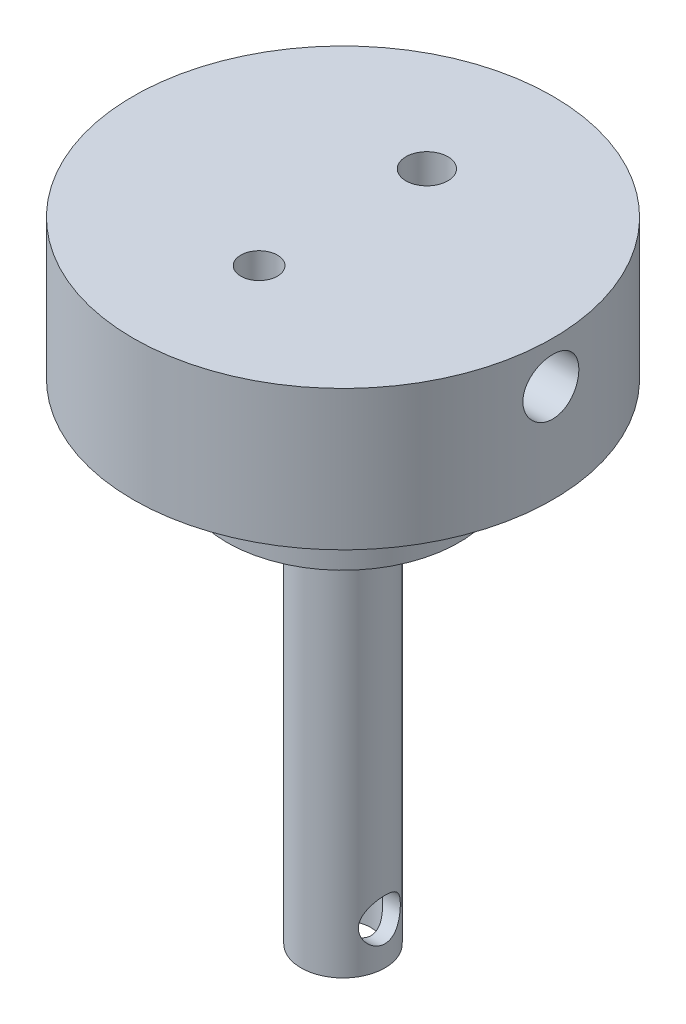
ISO-10303-21;
HEADER;
FILE_DESCRIPTION(('STEP AP214'),'2;1');
FILE_NAME('part.step','',(''),(''),'','','');
FILE_SCHEMA(('AUTOMOTIVE_DESIGN { 1 0 10303 214 1 1 1 1 }'));
ENDSEC;
DATA;
#1=APPLICATION_CONTEXT('core data for automotive mechanical design processes');
#2=APPLICATION_PROTOCOL_DEFINITION('international standard','automotive_design',2000,#1);
#3=PRODUCT_CONTEXT('',#1,'mechanical');
#4=PRODUCT('Part','Part','',(#3));
#5=PRODUCT_RELATED_PRODUCT_CATEGORY('part','',(#4));
#6=PRODUCT_DEFINITION_FORMATION('','',#4);
#7=PRODUCT_DEFINITION_CONTEXT('part definition',#1,'design');
#8=PRODUCT_DEFINITION('design','',#6,#7);
#9=PRODUCT_DEFINITION_SHAPE('','',#8);
#10=(LENGTH_UNIT() NAMED_UNIT(*) SI_UNIT(.MILLI.,.METRE.));
#11=(NAMED_UNIT(*) PLANE_ANGLE_UNIT() SI_UNIT($,.RADIAN.));
#12=(NAMED_UNIT(*) SI_UNIT($,.STERADIAN.) SOLID_ANGLE_UNIT());
#13=UNCERTAINTY_MEASURE_WITH_UNIT(LENGTH_MEASURE(1.E-05),#10,'distance_accuracy_value','');
#14=(GEOMETRIC_REPRESENTATION_CONTEXT(3) GLOBAL_UNCERTAINTY_ASSIGNED_CONTEXT((#13)) GLOBAL_UNIT_ASSIGNED_CONTEXT((#10,
#11,#12)) REPRESENTATION_CONTEXT('',''));
#15=CARTESIAN_POINT('',(0.,0.,0.));
#16=DIRECTION('',(0.,0.,1.));
#17=DIRECTION('',(1.,0.,0.));
#18=AXIS2_PLACEMENT_3D('',#15,#16,#17);
#19=CARTESIAN_POINT('',(0.,5.,0.));
#20=DIRECTION('',(0.,-1.,0.));
#21=DIRECTION('',(0.,0.,-1.));
#22=AXIS2_PLACEMENT_3D('',#19,#20,#21);
#23=CYLINDRICAL_SURFACE('',#22,7.5);
#24=CARTESIAN_POINT('',(0.,5.,0.));
#25=DIRECTION('',(0.,1.,0.));
#26=DIRECTION('',(0.,0.,1.));
#27=AXIS2_PLACEMENT_3D('',#24,#25,#26);
#28=CIRCLE('',#27,7.5);
#29=CARTESIAN_POINT('',(0.,5.,7.5));
#30=VERTEX_POINT('',#29);
#31=EDGE_CURVE('E52',#30,#30,#28,.T.);
#32=ORIENTED_EDGE('',*,*,#31,.F.);
#33=EDGE_LOOP('',(#32));
#34=FACE_BOUND('',#33,.T.);
#35=CARTESIAN_POINT('',(0.,0.,0.));
#36=DIRECTION('',(0.,1.,0.));
#37=DIRECTION('',(0.,0.,1.));
#38=AXIS2_PLACEMENT_3D('',#35,#36,#37);
#39=CIRCLE('',#38,7.5);
#40=CARTESIAN_POINT('',(0.,0.,7.5));
#41=VERTEX_POINT('',#40);
#42=EDGE_CURVE('E75',#41,#41,#39,.T.);
#43=ORIENTED_EDGE('',*,*,#42,.T.);
#44=EDGE_LOOP('',(#43));
#45=FACE_BOUND('',#44,.T.);
#46=CARTESIAN_POINT('',(7.43303437365925,3.5,-1.));
#47=CARTESIAN_POINT('',(7.43303522266631,3.44409807226988,-0.999997642974211));
#48=CARTESIAN_POINT('',(7.43367182371829,3.38816198345359,-0.995296633522848));
#49=CARTESIAN_POINT('',(7.43614824351763,3.27784876884303,-0.976618981332774));
#50=CARTESIAN_POINT('',(7.43798929330704,3.22347329754359,-0.962632848245786));
#51=CARTESIAN_POINT('',(7.44266246058434,3.11789431588298,-0.925806555700513));
#52=CARTESIAN_POINT('',(7.4454938777722,3.06668859419012,-0.902972651375006));
#53=CARTESIAN_POINT('',(7.45182791129731,2.96884446214626,-0.849112824403648));
#54=CARTESIAN_POINT('',(7.45533041990363,2.92220532053126,-0.818088216317403));
#55=CARTESIAN_POINT('',(7.46263688659337,2.83451327266549,-0.74851685244753));
#56=CARTESIAN_POINT('',(7.4664424424659,2.79349356716023,-0.709928411374281));
#57=CARTESIAN_POINT('',(7.47391188129393,2.71849187727188,-0.626414614363067));
#58=CARTESIAN_POINT('',(7.47757575696696,2.68451025426192,-0.581488933235995));
#59=CARTESIAN_POINT('',(7.48436549880109,2.62442907914178,-0.486365862463802));
#60=CARTESIAN_POINT('',(7.48748928251119,2.59835975535487,-0.43614921885561));
#61=CARTESIAN_POINT('',(7.49282926707925,2.5550369179096,-0.332001908018685));
#62=CARTESIAN_POINT('',(7.49504550607303,2.53778303381116,-0.2780713969612));
#63=CARTESIAN_POINT('',(7.49830943097799,2.51268054520987,-0.168367687507044));
#64=CARTESIAN_POINT('',(7.49936399102537,2.50477659249402,-0.112607361734948));
#65=CARTESIAN_POINT('',(7.5002092398576,2.49842669563159,-0.000542501151828087));
#66=CARTESIAN_POINT('',(7.49999998481415,2.49998033113174,0.0557620093612332));
#67=CARTESIAN_POINT('',(7.49834672058453,2.51245736527047,0.166940062232885));
#68=CARTESIAN_POINT('',(7.49691055668904,2.52332123237282,0.221820418680892));
#69=CARTESIAN_POINT('',(7.49297362046144,2.55401716351075,0.328972061356277));
#70=CARTESIAN_POINT('',(7.49047282557017,2.57384941758406,0.38124329227092));
#71=CARTESIAN_POINT('',(7.48467409502082,2.62198172056091,0.481875904212064));
#72=CARTESIAN_POINT('',(7.48137376072939,2.65030731159154,0.53022492467663));
#73=CARTESIAN_POINT('',(7.4743447520952,2.71460362864143,0.621505845367393));
#74=CARTESIAN_POINT('',(7.47061605542144,2.7505747533139,0.664437462933408));
#75=CARTESIAN_POINT('',(7.46311294047831,2.82947392417947,0.744015030772694));
#76=CARTESIAN_POINT('',(7.459338392122,2.87245388409682,0.780609516765105));
#77=CARTESIAN_POINT('',(7.45219749384618,2.96397296568629,0.846073465285955));
#78=CARTESIAN_POINT('',(7.44883114554537,3.01251210940148,0.874942897181765));
#79=CARTESIAN_POINT('',(7.4428878816717,3.11382000017335,0.9241414304325));
#80=CARTESIAN_POINT('',(7.44031138107393,3.16659095225924,0.944466044533533));
#81=CARTESIAN_POINT('',(7.43624737732859,3.27483901031919,0.97595045022462));
#82=CARTESIAN_POINT('',(7.43475981418081,3.33031596701328,0.987110746770717));
#83=CARTESIAN_POINT('',(7.43305322505173,3.44194566750248,0.999880803843635));
#84=CARTESIAN_POINT('',(7.43282455755814,3.49808996516627,1.00156315549406));
#85=CARTESIAN_POINT('',(7.43363612148349,3.60985962805237,0.995521440943979));
#86=CARTESIAN_POINT('',(7.43467632202375,3.66548500586973,0.987797603648882));
#87=CARTESIAN_POINT('',(7.43789960218385,3.77441799320281,0.963224025185098));
#88=CARTESIAN_POINT('',(7.44007823893825,3.82773374650905,0.946409751616799));
#89=CARTESIAN_POINT('',(7.44532929507204,3.93078945672622,0.904169225400626));
#90=CARTESIAN_POINT('',(7.44840174991421,3.98052927166186,0.878742631046915));
#91=CARTESIAN_POINT('',(7.45511723309759,4.07534865522041,0.819822032086054));
#92=CARTESIAN_POINT('',(7.45876356894567,4.12039852418412,0.786280615831502));
#93=CARTESIAN_POINT('',(7.46620571758255,4.20425546921854,0.712149161563995));
#94=CARTESIAN_POINT('',(7.47000153699967,4.24306226807401,0.67155881071877));
#95=CARTESIAN_POINT('',(7.47734474327666,4.31358827696056,0.584163774179118));
#96=CARTESIAN_POINT('',(7.48089035024858,4.34525965818581,0.537320320466262));
#97=CARTESIAN_POINT('',(7.48730670739152,4.40028414108766,0.43893622615881));
#98=CARTESIAN_POINT('',(7.49017747274246,4.42363742987805,0.38739569125685));
#99=CARTESIAN_POINT('',(7.49491282345577,4.46128463079406,0.281236386261717));
#100=CARTESIAN_POINT('',(7.49678042410392,4.47560571454177,0.226627392123681));
#101=CARTESIAN_POINT('',(7.49931158343309,4.49487024273049,0.115753246711599));
#102=CARTESIAN_POINT('',(7.49997520428063,4.49981417135386,0.0594881810999119));
#103=CARTESIAN_POINT('',(7.50002323624209,4.50017413362016,-0.0526349368557942));
#104=CARTESIAN_POINT('',(7.49941752456714,4.4956637352972,-0.10849276296094));
#105=CARTESIAN_POINT('',(7.4970146660993,4.47739947938401,-0.218648721526177));
#106=CARTESIAN_POINT('',(7.49521752097504,4.46364563473935,-0.272946856170523));
#107=CARTESIAN_POINT('',(7.49063278321235,4.42730897646167,-0.37842911729443));
#108=CARTESIAN_POINT('',(7.48784564204157,4.40473018679597,-0.429614650771955));
#109=CARTESIAN_POINT('',(7.48158874697992,4.35139222517713,-0.527482039315437));
#110=CARTESIAN_POINT('',(7.47811898048495,4.32063290217378,-0.574163811199582));
#111=CARTESIAN_POINT('',(7.47085145604927,4.25153665899818,-0.662073643033368));
#112=CARTESIAN_POINT('',(7.46705145149955,4.21314510493041,-0.703258578581999));
#113=CARTESIAN_POINT('',(7.45956932448384,4.12998846547632,-0.77862947793608));
#114=CARTESIAN_POINT('',(7.45588723005032,4.08522187803936,-0.812813787651156));
#115=CARTESIAN_POINT('',(7.4490405494253,3.99035802921457,-0.873343954892478));
#116=CARTESIAN_POINT('',(7.44587830880396,3.94023820424499,-0.89965470214564));
#117=CARTESIAN_POINT('',(7.4404568329187,3.83627576624143,-0.943447591407442));
#118=CARTESIAN_POINT('',(7.43819663011144,3.78243721512016,-0.960939198331794));
#119=CARTESIAN_POINT('',(7.43537566912471,3.69027586063733,-0.982477401892939));
#120=CARTESIAN_POINT('',(7.4345021431111,3.65253086351626,-0.98903874067909));
#121=CARTESIAN_POINT('',(7.43333120737231,3.57652924526442,-0.99780082671583));
#122=CARTESIAN_POINT('',(7.43303379239608,3.5382726288001,-1.00000161371131));
#123=CARTESIAN_POINT('',(7.43303437365925,3.5,-1.));
#124=B_SPLINE_CURVE_WITH_KNOTS('',3,(#46,#47,#48,#49,#50,#51,#52,#53,#54,#55,#56,#57,#58,#59,
#60,#61,#62,#63,#64,#65,#66,#67,#68,#69,#70,#71,#72,#73,#74,#75,#76,#77,#78,#79,#80,#81,#82,#83,
#84,#85,#86,#87,#88,#89,#90,#91,#92,#93,#94,#95,#96,#97,#98,#99,#100,#101,#102,#103,#104,#105,
#106,#107,#108,#109,#110,#111,#112,#113,#114,#115,#116,#117,#118,#119,#120,#121,#122,#123),
.UNSPECIFIED.,.T.,.F.,(4,2,2,2,2,2,2,2,2,2,2,2,2,2,2,2,2,2,2,2,2,2,2,2,2,2,2,2,2,2,2,2,2,2,2,2,
2,2,4),(0.,0.16756594461955,0.335303423041821,0.502922531373103,0.670514754163761,
0.839057975594805,1.00760984880017,1.17679778261471,1.34597860627362,1.51415284761382,
1.68231961431326,1.84941904333874,2.01652201332237,2.18413264227024,2.35175201291212,
2.52067457533377,2.68959780758443,2.85860963826768,3.02761215573449,3.19531851289863,
3.36302078890669,3.53007342408195,3.69713268808003,3.86519264070064,4.03326005374209,
4.2024225588115,4.37158125836474,4.54022861884065,4.70886727109971,4.87619854927048,
5.04352959309218,5.21078442673995,5.37804234889437,5.5465437118337,5.71508484203598,
5.88436670989948,6.05346651155518,6.16818970471025,6.28291185219902),.UNSPECIFIED.);
#125=CARTESIAN_POINT('',(7.43303437365925,3.5,-1.));
#126=VERTEX_POINT('',#125);
#127=EDGE_CURVE('E65',#126,#126,#124,.T.);
#128=ORIENTED_EDGE('',*,*,#127,.T.);
#129=EDGE_LOOP('',(#128));
#130=FACE_BOUND('',#129,.T.);
#131=ADVANCED_FACE('F35',(#34,#45,#130),#23,.T.);
#132=CARTESIAN_POINT('',(0.,5.,0.));
#133=DIRECTION('',(0.,1.,0.));
#134=DIRECTION('',(0.,0.,1.));
#135=AXIS2_PLACEMENT_3D('',#132,#133,#134);
#136=PLANE('',#135);
#137=CARTESIAN_POINT('',(0.,5.,3.));
#138=DIRECTION('',(0.,1.,0.));
#139=DIRECTION('',(0.,0.,1.));
#140=AXIS2_PLACEMENT_3D('',#137,#138,#139);
#141=CIRCLE('',#140,0.65493763905522);
#142=CARTESIAN_POINT('',(0.,5.,3.65493763905522));
#143=VERTEX_POINT('',#142);
#144=EDGE_CURVE('E155',#143,#143,#141,.T.);
#145=ORIENTED_EDGE('',*,*,#144,.F.);
#146=EDGE_LOOP('',(#145));
#147=FACE_BOUND('',#146,.T.);
#148=CARTESIAN_POINT('',(0.,5.,-3.));
#149=DIRECTION('',(0.,1.,0.));
#150=DIRECTION('',(0.,0.,1.));
#151=AXIS2_PLACEMENT_3D('',#148,#149,#150);
#152=CIRCLE('',#151,0.75);
#153=CARTESIAN_POINT('',(0.,5.,-2.25));
#154=VERTEX_POINT('',#153);
#155=EDGE_CURVE('E296',#154,#154,#152,.T.);
#156=ORIENTED_EDGE('',*,*,#155,.F.);
#157=EDGE_LOOP('',(#156));
#158=FACE_BOUND('',#157,.T.);
#159=ORIENTED_EDGE('',*,*,#31,.T.);
#160=EDGE_LOOP('',(#159));
#161=FACE_BOUND('',#160,.T.);
#162=ADVANCED_FACE('F82',(#147,#158,#161),#136,.T.);
#163=CARTESIAN_POINT('',(0.,0.,0.));
#164=DIRECTION('',(0.,1.,0.));
#165=DIRECTION('',(0.,0.,1.));
#166=AXIS2_PLACEMENT_3D('',#163,#164,#165);
#167=PLANE('',#166);
#168=CARTESIAN_POINT('',(0.,0.,0.));
#169=DIRECTION('',(0.,1.,0.));
#170=DIRECTION('',(0.,0.,1.));
#171=AXIS2_PLACEMENT_3D('',#168,#169,#170);
#172=CIRCLE('',#171,4.15);
#173=CARTESIAN_POINT('',(0.,0.,4.15));
#174=VERTEX_POINT('',#173);
#175=EDGE_CURVE('E47',#174,#174,#172,.F.);
#176=ORIENTED_EDGE('',*,*,#175,.F.);
#177=EDGE_LOOP('',(#176));
#178=FACE_BOUND('',#177,.T.);
#179=ORIENTED_EDGE('',*,*,#42,.F.);
#180=EDGE_LOOP('',(#179));
#181=FACE_BOUND('',#180,.T.);
#182=ADVANCED_FACE('F84',(#178,#181),#167,.F.);
#183=CARTESIAN_POINT('',(0.,-1.,0.));
#184=DIRECTION('',(0.,1.,0.));
#185=DIRECTION('',(0.,0.,1.));
#186=AXIS2_PLACEMENT_3D('',#183,#184,#185);
#187=CYLINDRICAL_SURFACE('',#186,1.);
#188=CARTESIAN_POINT('',(-0.661437827766147,-16.,-0.75));
#189=CARTESIAN_POINT('',(-0.661445950221147,-15.9650012882874,-0.749996095247428));
#190=CARTESIAN_POINT('',(-0.664281833080045,-15.9299770828451,-0.747520545372942));
#191=CARTESIAN_POINT('',(-0.674953220161037,-15.8613350718942,-0.737891666051201));
#192=CARTESIAN_POINT('',(-0.682803625832129,-15.8277217774864,-0.73072439282475));
#193=CARTESIAN_POINT('',(-0.701875639595421,-15.7632100766346,-0.712419194962372));
#194=CARTESIAN_POINT('',(-0.713049241265151,-15.7322806116329,-0.701337417236441));
#195=CARTESIAN_POINT('',(-0.737432275115262,-15.6728272727633,-0.675653276485156));
#196=CARTESIAN_POINT('',(-0.750641461171438,-15.6443031087126,-0.661051338964957));
#197=CARTESIAN_POINT('',(-0.780886564990612,-15.5839436019064,-0.625199549108391));
#198=CARTESIAN_POINT('',(-0.798144520806827,-15.5526660331499,-0.603197869968367));
#199=CARTESIAN_POINT('',(-0.832605821261326,-15.4937372671492,-0.554667984019512));
#200=CARTESIAN_POINT('',(-0.849809046925669,-15.4660915176687,-0.528133111479218));
#201=CARTESIAN_POINT('',(-0.886312911908123,-15.4095706305783,-0.464805096048829));
#202=CARTESIAN_POINT('',(-0.905324606076556,-15.3815970166152,-0.427023644550603));
#203=CARTESIAN_POINT('',(-0.939414048830227,-15.3326888958834,-0.345594857431398));
#204=CARTESIAN_POINT('',(-0.954501020916616,-15.3117378512711,-0.301961646922642));
#205=CARTESIAN_POINT('',(-0.975171294940006,-15.2833961570447,-0.223934511988637));
#206=CARTESIAN_POINT('',(-0.982248554602023,-15.2738214520097,-0.190723024845414));
#207=CARTESIAN_POINT('',(-0.993028179690781,-15.2593049420027,-0.122776304659122));
#208=CARTESIAN_POINT('',(-0.996733477162626,-15.2543591119469,-0.0880424229978122));
#209=CARTESIAN_POINT('',(-1.00045687788962,-15.2493891330685,-0.0179325463107836));
#210=CARTESIAN_POINT('',(-1.00046540028726,-15.2493777728117,0.017444879559382));
#211=CARTESIAN_POINT('',(-0.996771032515545,-15.2543089683902,0.0876580783369581));
#212=CARTESIAN_POINT('',(-0.993067282856744,-15.2592526714541,0.122493723911098));
#213=CARTESIAN_POINT('',(-0.982456889722001,-15.2735405252949,0.189444596896342));
#214=CARTESIAN_POINT('',(-0.975664288828385,-15.2827281631935,0.221612134118153));
#215=CARTESIAN_POINT('',(-0.959411393285098,-15.3049978210911,0.283840242523195));
#216=CARTESIAN_POINT('',(-0.949950516970971,-15.3180806902566,0.313900352516818));
#217=CARTESIAN_POINT('',(-0.927805229922517,-15.3492648075727,0.374608460932367));
#218=CARTESIAN_POINT('',(-0.914882703040484,-15.3677560483094,0.404967692356801));
#219=CARTESIAN_POINT('',(-0.887303512418695,-15.4083668519853,0.462283625274143));
#220=CARTESIAN_POINT('',(-0.872645373902267,-15.43048950685,0.489237392310611));
#221=CARTESIAN_POINT('',(-0.839468829361797,-15.4826116744105,0.544541021416645));
#222=CARTESIAN_POINT('',(-0.820758279331839,-15.5133046050132,0.572122465023923));
#223=CARTESIAN_POINT('',(-0.783629791418846,-15.578917291811,0.62200437778114));
#224=CARTESIAN_POINT('',(-0.765211996817616,-15.6138390497625,0.644302331057385));
#225=CARTESIAN_POINT('',(-0.734097129995795,-15.6804909351228,0.679366032058004));
#226=CARTESIAN_POINT('',(-0.720987998949911,-15.7114935226503,0.693144334340514));
#227=CARTESIAN_POINT('',(-0.697683706286968,-15.7760326407097,0.716596985543921));
#228=CARTESIAN_POINT('',(-0.687481976602555,-15.8095632398452,0.726280609041295));
#229=CARTESIAN_POINT('',(-0.67320025310116,-15.8718434719992,0.739511926753348));
#230=CARTESIAN_POINT('',(-0.66830769778435,-15.9002235410584,0.743895347482908));
#231=CARTESIAN_POINT('',(-0.662177942191669,-15.9576777330869,0.749358803098946));
#232=CARTESIAN_POINT('',(-0.660936065291536,-15.9867509199514,0.750443064366328));
#233=CARTESIAN_POINT('',(-0.662314343952486,-16.0447394958667,0.749226350577758));
#234=CARTESIAN_POINT('',(-0.66493592103582,-16.0736548229048,0.74692412949745));
#235=CARTESIAN_POINT('',(-0.673606093875233,-16.1305380762214,0.739112636359845));
#236=CARTESIAN_POINT('',(-0.679660538636729,-16.1585042989741,0.733597890281969));
#237=CARTESIAN_POINT('',(-0.697138791439013,-16.2231690224694,0.717069797811931));
#238=CARTESIAN_POINT('',(-0.709724118486581,-16.2592179769575,0.704770948846204));
#239=CARTESIAN_POINT('',(-0.737689305399884,-16.3281538318201,0.675444389192168));
#240=CARTESIAN_POINT('',(-0.753074292386158,-16.3610347586474,0.658407971677375));
#241=CARTESIAN_POINT('',(-0.785541411878257,-16.4246745040241,0.619348870583468));
#242=CARTESIAN_POINT('',(-0.802664419230237,-16.4553164381091,0.597170550301694));
#243=CARTESIAN_POINT('',(-0.836737531361815,-16.5130010481806,0.548412814572947));
#244=CARTESIAN_POINT('',(-0.853687547873334,-16.5400419639945,0.521831260972301));
#245=CARTESIAN_POINT('',(-0.889801113117671,-16.5956384958147,0.458117256914793));
#246=CARTESIAN_POINT('',(-0.908640870826792,-16.6232376194288,0.419948135473409));
#247=CARTESIAN_POINT('',(-0.942265523849135,-16.6713103667254,0.337775806325613));
#248=CARTESIAN_POINT('',(-0.957059180261423,-16.6917994122907,0.293785514987405));
#249=CARTESIAN_POINT('',(-0.977097032011902,-16.7192189957234,0.215377830748434));
#250=CARTESIAN_POINT('',(-0.983877390148202,-16.7283783966377,0.182125028663715));
#251=CARTESIAN_POINT('',(-0.994051327945617,-16.7420643981538,0.114182232482155));
#252=CARTESIAN_POINT('',(-0.997447935534801,-16.7465951407743,0.0794935522809507));
#253=CARTESIAN_POINT('',(-1.00056783358531,-16.7507581954643,0.00957380297017983));
#254=CARTESIAN_POINT('',(-1.00028250109453,-16.7503790086741,-0.0256583462935627));
#255=CARTESIAN_POINT('',(-0.996044016219049,-16.7447195043494,-0.0955045055150584));
#256=CARTESIAN_POINT('',(-0.992089886721752,-16.7394378811463,-0.130118348295662));
#257=CARTESIAN_POINT('',(-0.981017004625972,-16.7245125419164,-0.196760967627503));
#258=CARTESIAN_POINT('',(-0.97399345396439,-16.7149999093392,-0.228835618255738));
#259=CARTESIAN_POINT('',(-0.957313602875676,-16.6921059671905,-0.290830671548711));
#260=CARTESIAN_POINT('',(-0.947656739311926,-16.6787238300845,-0.320750611694424));
#261=CARTESIAN_POINT('',(-0.925088211053196,-16.646861031202,-0.381273849383422));
#262=CARTESIAN_POINT('',(-0.911931763537898,-16.6279745343202,-0.411570618356724));
#263=CARTESIAN_POINT('',(-0.883927530378576,-16.5865667797229,-0.468707405862122));
#264=CARTESIAN_POINT('',(-0.869078193978281,-16.564042181357,-0.495544206191701));
#265=CARTESIAN_POINT('',(-0.835531765210522,-16.5109973167196,-0.550561903303419));
#266=CARTESIAN_POINT('',(-0.816654612523478,-16.47977680028,-0.577958457709991));
#267=CARTESIAN_POINT('',(-0.77933041231665,-16.41306596405,-0.627376267146762));
#268=CARTESIAN_POINT('',(-0.760883524609442,-16.3775740869817,-0.649395552783653));
#269=CARTESIAN_POINT('',(-0.730248007246418,-16.3105583747048,-0.683479856507284));
#270=CARTESIAN_POINT('',(-0.717568125038191,-16.2798325086467,-0.696667631690004));
#271=CARTESIAN_POINT('',(-0.695162823256141,-16.215958543472,-0.719026990142997));
#272=CARTESIAN_POINT('',(-0.685429579498417,-16.1828171542022,-0.728209238391707));
#273=CARTESIAN_POINT('',(-0.672662116916347,-16.1246058902015,-0.739985288781916));
#274=CARTESIAN_POINT('',(-0.668500651328527,-16.1000164643548,-0.743721245134371));
#275=CARTESIAN_POINT('',(-0.662886476962141,-16.0502888334831,-0.748729195362205));
#276=CARTESIAN_POINT('',(-0.661431990755244,-16.025150999528,-0.750002806058432));
#277=CARTESIAN_POINT('',(-0.661437827766147,-16.,-0.75));
#278=B_SPLINE_CURVE_WITH_KNOTS('',3,(#188,#189,#190,#191,#192,#193,#194,#195,#196,#197,#198,
#199,#200,#201,#202,#203,#204,#205,#206,#207,#208,#209,#210,#211,#212,#213,#214,#215,#216,#217,
#218,#219,#220,#221,#222,#223,#224,#225,#226,#227,#228,#229,#230,#231,#232,#233,#234,#235,#236,
#237,#238,#239,#240,#241,#242,#243,#244,#245,#246,#247,#248,#249,#250,#251,#252,#253,#254,#255,
#256,#257,#258,#259,#260,#261,#262,#263,#264,#265,#266,#267,#268,#269,#270,#271,#272,#273,#274,
#275,#276,#277),.UNSPECIFIED.,.T.,.F.,(4,2,2,2,2,2,2,2,2,2,2,2,2,2,2,2,2,2,2,2,2,2,2,2,2,2,2,2,
2,2,2,2,2,2,2,2,2,2,2,2,2,2,2,2,4),(0.,0.104865888342249,0.210044861291498,0.31377269281007,
0.417487992336175,0.542926043452543,0.668550155159986,0.81982424051843,0.970739537225556,
1.07613862638852,1.18144597935429,1.28702625363977,1.39263097820718,1.49461877947599,
1.59662883054409,1.70968422058521,1.82283637443906,1.95824758602425,2.09372314824041,
2.20249704738673,2.31102323306577,2.39804002773025,2.48494530269171,2.57188256163181,
2.65896839348085,2.77865014101274,2.89855331319652,3.02271604545106,3.14693924723385,
3.29826249755808,3.44925544293359,3.55426448097289,3.65917946769666,3.76434020550597,
3.86952895887048,3.97166406346032,4.07382102689742,4.18755026244881,4.30138452872398,
4.43773790289153,4.57414114104342,4.68109139820493,4.78775512886425,4.86316406036958,
4.93852346016278),.UNSPECIFIED.);
#279=CARTESIAN_POINT('',(-0.661437827766147,-16.,-0.75));
#280=VERTEX_POINT('',#279);
#281=EDGE_CURVE('E123',#280,#280,#278,.T.);
#282=ORIENTED_EDGE('',*,*,#281,.F.);
#283=EDGE_LOOP('',(#282));
#284=FACE_BOUND('',#283,.T.);
#285=CARTESIAN_POINT('',(0.661437827766147,-16.,-0.75));
#286=CARTESIAN_POINT('',(0.661445950221147,-16.0349987117126,-0.749996095247428));
#287=CARTESIAN_POINT('',(0.664281833080044,-16.0700229171549,-0.747520545372942));
#288=CARTESIAN_POINT('',(0.674953220161037,-16.1386649281058,-0.737891666051201));
#289=CARTESIAN_POINT('',(0.682803625832129,-16.1722782225136,-0.73072439282475));
#290=CARTESIAN_POINT('',(0.701875639595421,-16.2367899233654,-0.712419194962372));
#291=CARTESIAN_POINT('',(0.71304924126515,-16.2677193883671,-0.701337417236441));
#292=CARTESIAN_POINT('',(0.737432275115262,-16.3271727272368,-0.675653276485157));
#293=CARTESIAN_POINT('',(0.750641461171437,-16.3556968912874,-0.661051338964957));
#294=CARTESIAN_POINT('',(0.780886564990612,-16.4160563980936,-0.625199549108391));
#295=CARTESIAN_POINT('',(0.798144520806827,-16.4473339668501,-0.603197869968367));
#296=CARTESIAN_POINT('',(0.832605821261326,-16.5062627328508,-0.554667984019511));
#297=CARTESIAN_POINT('',(0.849809046925669,-16.5339084823313,-0.528133111479218));
#298=CARTESIAN_POINT('',(0.886312911908123,-16.5904293694217,-0.464805096048829));
#299=CARTESIAN_POINT('',(0.905324606076556,-16.6184029833848,-0.427023644550603));
#300=CARTESIAN_POINT('',(0.939414048830227,-16.6673111041166,-0.345594857431398));
#301=CARTESIAN_POINT('',(0.954501020916616,-16.6882621487289,-0.301961646922642));
#302=CARTESIAN_POINT('',(0.975171294940006,-16.7166038429553,-0.223934511988637));
#303=CARTESIAN_POINT('',(0.982248554602023,-16.7261785479903,-0.190723024845415));
#304=CARTESIAN_POINT('',(0.993028179690781,-16.7406950579973,-0.122776304659123));
#305=CARTESIAN_POINT('',(0.996733477162626,-16.7456408880531,-0.088042422997813));
#306=CARTESIAN_POINT('',(1.00045687788962,-16.7506108669315,-0.0179325463107842));
#307=CARTESIAN_POINT('',(1.00046540028726,-16.7506222271883,0.0174448795593811));
#308=CARTESIAN_POINT('',(0.996771032515545,-16.7456910316098,0.0876580783369571));
#309=CARTESIAN_POINT('',(0.993067282856744,-16.7407473285459,0.122493723911097));
#310=CARTESIAN_POINT('',(0.982456889722001,-16.7264594747051,0.189444596896341));
#311=CARTESIAN_POINT('',(0.975664288828385,-16.7172718368065,0.221612134118151));
#312=CARTESIAN_POINT('',(0.959411393285099,-16.6950021789089,0.283840242523193));
#313=CARTESIAN_POINT('',(0.949950516970971,-16.6819193097434,0.313900352516817));
#314=CARTESIAN_POINT('',(0.927805229922517,-16.6507351924273,0.374608460932367));
#315=CARTESIAN_POINT('',(0.914882703040485,-16.6322439516906,0.4049676923568));
#316=CARTESIAN_POINT('',(0.887303512418696,-16.5916331480147,0.462283625274141));
#317=CARTESIAN_POINT('',(0.872645373902268,-16.5695104931501,0.48923739231061));
#318=CARTESIAN_POINT('',(0.839468829361798,-16.5173883255895,0.544541021416643));
#319=CARTESIAN_POINT('',(0.82075827933184,-16.4866953949868,0.57212246502392));
#320=CARTESIAN_POINT('',(0.783629791418848,-16.421082708189,0.622004377781139));
#321=CARTESIAN_POINT('',(0.765211996817617,-16.3861609502375,0.644302331057385));
#322=CARTESIAN_POINT('',(0.734097129995795,-16.3195090648772,0.679366032058004));
#323=CARTESIAN_POINT('',(0.720987998949912,-16.2885064773497,0.693144334340514));
#324=CARTESIAN_POINT('',(0.697683706286969,-16.2239673592903,0.716596985543921));
#325=CARTESIAN_POINT('',(0.687481976602556,-16.1904367601548,0.726280609041295));
#326=CARTESIAN_POINT('',(0.67320025310116,-16.1281565280008,0.739511926753347));
#327=CARTESIAN_POINT('',(0.66830769778435,-16.0997764589416,0.743895347482908));
#328=CARTESIAN_POINT('',(0.662177942191669,-16.0423222669131,0.749358803098946));
#329=CARTESIAN_POINT('',(0.660936065291536,-16.0132490800486,0.750443064366328));
#330=CARTESIAN_POINT('',(0.662314343952486,-15.9552605041333,0.749226350577758));
#331=CARTESIAN_POINT('',(0.66493592103582,-15.9263451770952,0.74692412949745));
#332=CARTESIAN_POINT('',(0.673606093875233,-15.8694619237786,0.739112636359845));
#333=CARTESIAN_POINT('',(0.679660538636728,-15.8414957010259,0.733597890281969));
#334=CARTESIAN_POINT('',(0.697138791439013,-15.7768309775306,0.717069797811931));
#335=CARTESIAN_POINT('',(0.70972411848658,-15.7407820230425,0.704770948846205));
#336=CARTESIAN_POINT('',(0.737689305399883,-15.6718461681799,0.67544438919217));
#337=CARTESIAN_POINT('',(0.753074292386156,-15.6389652413526,0.658407971677377));
#338=CARTESIAN_POINT('',(0.785541411878255,-15.5753254959759,0.619348870583471));
#339=CARTESIAN_POINT('',(0.802664419230235,-15.5446835618909,0.597170550301697));
#340=CARTESIAN_POINT('',(0.836737531361813,-15.4869989518194,0.548412814572949));
#341=CARTESIAN_POINT('',(0.853687547873333,-15.4599580360055,0.521831260972303));
#342=CARTESIAN_POINT('',(0.889801113117671,-15.4043615041853,0.458117256914794));
#343=CARTESIAN_POINT('',(0.908640870826791,-15.3767623805712,0.41994813547341));
#344=CARTESIAN_POINT('',(0.942265523849134,-15.3286896332746,0.337775806325615));
#345=CARTESIAN_POINT('',(0.957059180261423,-15.3082005877093,0.293785514987406));
#346=CARTESIAN_POINT('',(0.977097032011902,-15.2807810042766,0.215377830748435));
#347=CARTESIAN_POINT('',(0.983877390148202,-15.2716216033623,0.182125028663716));
#348=CARTESIAN_POINT('',(0.994051327945617,-15.2579356018462,0.114182232482155));
#349=CARTESIAN_POINT('',(0.997447935534801,-15.2534048592257,0.0794935522809508));
#350=CARTESIAN_POINT('',(1.00056783358531,-15.2492418045357,0.00957380297017928));
#351=CARTESIAN_POINT('',(1.00028250109453,-15.2496209913259,-0.0256583462935635));
#352=CARTESIAN_POINT('',(0.996044016219049,-15.2552804956506,-0.0955045055150593));
#353=CARTESIAN_POINT('',(0.992089886721752,-15.2605621188537,-0.130118348295663));
#354=CARTESIAN_POINT('',(0.981017004625972,-15.2754874580836,-0.196760967627504));
#355=CARTESIAN_POINT('',(0.97399345396439,-15.2850000906608,-0.228835618255738));
#356=CARTESIAN_POINT('',(0.957313602875676,-15.3078940328095,-0.290830671548711));
#357=CARTESIAN_POINT('',(0.947656739311926,-15.3212761699155,-0.320750611694424));
#358=CARTESIAN_POINT('',(0.925088211053196,-15.353138968798,-0.381273849383422));
#359=CARTESIAN_POINT('',(0.911931763537898,-15.3720254656798,-0.411570618356724));
#360=CARTESIAN_POINT('',(0.883927530378575,-15.4134332202771,-0.468707405862122));
#361=CARTESIAN_POINT('',(0.869078193978281,-15.435957818643,-0.495544206191701));
#362=CARTESIAN_POINT('',(0.835531765210522,-15.4890026832804,-0.55056190330342));
#363=CARTESIAN_POINT('',(0.816654612523477,-15.52022319972,-0.577958457709993));
#364=CARTESIAN_POINT('',(0.779330412316648,-15.58693403595,-0.627376267146764));
#365=CARTESIAN_POINT('',(0.760883524609442,-15.6224259130183,-0.649395552783654));
#366=CARTESIAN_POINT('',(0.730248007246417,-15.6894416252952,-0.683479856507285));
#367=CARTESIAN_POINT('',(0.717568125038191,-15.7201674913533,-0.696667631690004));
#368=CARTESIAN_POINT('',(0.695162823256141,-15.784041456528,-0.719026990142997));
#369=CARTESIAN_POINT('',(0.685429579498417,-15.8171828457978,-0.728209238391707));
#370=CARTESIAN_POINT('',(0.672662116916347,-15.8753941097985,-0.739985288781916));
#371=CARTESIAN_POINT('',(0.668500651328527,-15.8999835356452,-0.743721245134371));
#372=CARTESIAN_POINT('',(0.662886476962141,-15.9497111665169,-0.748729195362205));
#373=CARTESIAN_POINT('',(0.661431990755244,-15.974849000472,-0.750002806058432));
#374=CARTESIAN_POINT('',(0.661437827766147,-16.,-0.75));
#375=B_SPLINE_CURVE_WITH_KNOTS('',3,(#285,#286,#287,#288,#289,#290,#291,#292,#293,#294,#295,
#296,#297,#298,#299,#300,#301,#302,#303,#304,#305,#306,#307,#308,#309,#310,#311,#312,#313,#314,
#315,#316,#317,#318,#319,#320,#321,#322,#323,#324,#325,#326,#327,#328,#329,#330,#331,#332,#333,
#334,#335,#336,#337,#338,#339,#340,#341,#342,#343,#344,#345,#346,#347,#348,#349,#350,#351,#352,
#353,#354,#355,#356,#357,#358,#359,#360,#361,#362,#363,#364,#365,#366,#367,#368,#369,#370,#371,
#372,#373,#374),.UNSPECIFIED.,.T.,.F.,(4,2,2,2,2,2,2,2,2,2,2,2,2,2,2,2,2,2,2,2,2,2,2,2,2,2,2,2,
2,2,2,2,2,2,2,2,2,2,2,2,2,2,2,2,4),(0.,0.104865888342249,0.210044861291498,0.313772692810073,
0.417487992336173,0.542926043452545,0.668550155159987,0.819824240518431,0.970739537225556,
1.07613862638851,1.18144597935429,1.28702625363977,1.39263097820718,1.49461877947599,
1.59662883054408,1.70968422058521,1.82283637443905,1.95824758602425,2.09372314824041,
2.20249704738672,2.31102323306577,2.39804002773025,2.48494530269171,2.57188256163181,
2.65896839348085,2.77865014101274,2.89855331319651,3.02271604545106,3.14693924723385,
3.29826249755808,3.44925544293359,3.55426448097289,3.65917946769666,3.76434020550598,
3.86952895887048,3.97166406346032,4.07382102689742,4.18755026244881,4.30138452872399,
4.43773790289154,4.57414114104342,4.68109139820494,4.78775512886425,4.86316406036958,
4.93852346016279),.UNSPECIFIED.);
#376=CARTESIAN_POINT('',(0.661437827766147,-16.,-0.75));
#377=VERTEX_POINT('',#376);
#378=EDGE_CURVE('E126',#377,#377,#375,.T.);
#379=ORIENTED_EDGE('',*,*,#378,.F.);
#380=EDGE_LOOP('',(#379));
#381=FACE_BOUND('',#380,.T.);
#382=CARTESIAN_POINT('',(0.,0.5,0.));
#383=DIRECTION('',(0.,-1.,0.));
#384=DIRECTION('',(0.,0.,-1.));
#385=AXIS2_PLACEMENT_3D('',#382,#383,#384);
#386=CIRCLE('',#385,1.);
#387=CARTESIAN_POINT('',(-1.,0.5,0.));
#388=VERTEX_POINT('',#387);
#389=EDGE_CURVE('E61',#388,#388,#386,.T.);
#390=ORIENTED_EDGE('',*,*,#389,.F.);
#391=EDGE_LOOP('',(#390));
#392=FACE_BOUND('',#391,.T.);
#393=CARTESIAN_POINT('',(0.,-17.5,0.));
#394=DIRECTION('',(0.,-1.,0.));
#395=DIRECTION('',(0.,0.,-1.));
#396=AXIS2_PLACEMENT_3D('',#393,#394,#395);
#397=CIRCLE('',#396,1.);
#398=CARTESIAN_POINT('',(0.,-17.5,-1.));
#399=VERTEX_POINT('',#398);
#400=EDGE_CURVE('E121',#399,#399,#397,.T.);
#401=ORIENTED_EDGE('',*,*,#400,.T.);
#402=EDGE_LOOP('',(#401));
#403=FACE_BOUND('',#402,.T.);
#404=ADVANCED_FACE('F87',(#284,#381,#392,#403),#187,.F.);
#405=CARTESIAN_POINT('',(3.,0.5,0.));
#406=DIRECTION('',(0.,0.,-1.));
#407=DIRECTION('',(-1.,0.,0.));
#408=AXIS2_PLACEMENT_3D('',#405,#406,#407);
#409=TOROIDAL_SURFACE('',#408,3.,1.);
#410=CARTESIAN_POINT('',(3.,3.5,0.));
#411=DIRECTION('',(-1.,0.,0.));
#412=DIRECTION('',(0.,0.,-1.));
#413=AXIS2_PLACEMENT_3D('',#410,#411,#412);
#414=CIRCLE('',#413,1.);
#415=CARTESIAN_POINT('',(3.,4.5,0.));
#416=VERTEX_POINT('',#415);
#417=EDGE_CURVE('E62',#416,#416,#414,.T.);
#418=CARTESIAN_POINT('',(3.,0.5,0.));
#419=DIRECTION('',(0.,0.,-1.));
#420=DIRECTION('',(-1.,0.,0.));
#421=AXIS2_PLACEMENT_3D('',#418,#419,#420);
#422=CIRCLE('',#421,4.);
#423=EDGE_CURVE('',#388,#416,#422,.T.);
#424=ORIENTED_EDGE('',*,*,#389,.T.);
#425=ORIENTED_EDGE('',*,*,#417,.F.);
#426=ORIENTED_EDGE('',*,*,#423,.T.);
#427=ORIENTED_EDGE('',*,*,#423,.F.);
#428=EDGE_LOOP('',(#424,#426,#425,#427));
#429=FACE_BOUND('',#428,.T.);
#430=ADVANCED_FACE('F92',(#429),#409,.F.);
#431=CARTESIAN_POINT('',(3.,3.5,0.));
#432=DIRECTION('',(1.,0.,0.));
#433=DIRECTION('',(0.,0.,-1.));
#434=AXIS2_PLACEMENT_3D('',#431,#432,#433);
#435=CYLINDRICAL_SURFACE('',#434,1.);
#436=ORIENTED_EDGE('',*,*,#127,.F.);
#437=EDGE_LOOP('',(#436));
#438=FACE_BOUND('',#437,.T.);
#439=ORIENTED_EDGE('',*,*,#417,.T.);
#440=EDGE_LOOP('',(#439));
#441=FACE_BOUND('',#440,.T.);
#442=ADVANCED_FACE('F77',(#438,#441),#435,.F.);
#443=CARTESIAN_POINT('',(0.,-3.,0.));
#444=DIRECTION('',(0.,1.,0.));
#445=DIRECTION('',(0.,0.,1.));
#446=AXIS2_PLACEMENT_3D('',#443,#444,#445);
#447=CYLINDRICAL_SURFACE('',#446,4.15);
#448=CARTESIAN_POINT('',(0.,-3.,0.));
#449=DIRECTION('',(0.,-1.,0.));
#450=DIRECTION('',(0.,0.,-1.));
#451=AXIS2_PLACEMENT_3D('',#448,#449,#450);
#452=CIRCLE('',#451,4.15);
#453=CARTESIAN_POINT('',(0.,-3.,-4.15));
#454=VERTEX_POINT('',#453);
#455=EDGE_CURVE('E58',#454,#454,#452,.T.);
#456=ORIENTED_EDGE('',*,*,#455,.F.);
#457=EDGE_LOOP('',(#456));
#458=FACE_BOUND('',#457,.T.);
#459=ORIENTED_EDGE('',*,*,#175,.T.);
#460=EDGE_LOOP('',(#459));
#461=FACE_BOUND('',#460,.T.);
#462=ADVANCED_FACE('F94',(#458,#461),#447,.T.);
#463=CARTESIAN_POINT('',(0.,-3.,0.));
#464=DIRECTION('',(0.,-1.,0.));
#465=DIRECTION('',(0.,0.,-1.));
#466=AXIS2_PLACEMENT_3D('',#463,#464,#465);
#467=PLANE('',#466);
#468=CARTESIAN_POINT('',(0.,-3.,3.));
#469=DIRECTION('',(0.,-1.,0.));
#470=DIRECTION('',(0.,0.,-1.));
#471=AXIS2_PLACEMENT_3D('',#468,#469,#470);
#472=CIRCLE('',#471,0.65493763905522);
#473=CARTESIAN_POINT('',(0.,-3.,2.34506236094478));
#474=VERTEX_POINT('',#473);
#475=EDGE_CURVE('E295',#474,#474,#472,.T.);
#476=ORIENTED_EDGE('',*,*,#475,.F.);
#477=EDGE_LOOP('',(#476));
#478=FACE_BOUND('',#477,.T.);
#479=CARTESIAN_POINT('',(0.,-3.,-3.));
#480=DIRECTION('',(0.,-1.,0.));
#481=DIRECTION('',(0.,0.,-1.));
#482=AXIS2_PLACEMENT_3D('',#479,#480,#481);
#483=CIRCLE('',#482,0.75);
#484=CARTESIAN_POINT('',(0.,-3.,-3.75));
#485=VERTEX_POINT('',#484);
#486=EDGE_CURVE('E297',#485,#485,#483,.T.);
#487=ORIENTED_EDGE('',*,*,#486,.F.);
#488=EDGE_LOOP('',(#487));
#489=FACE_BOUND('',#488,.T.);
#490=CARTESIAN_POINT('',(0.,-3.,0.));
#491=DIRECTION('',(0.,-1.,0.));
#492=DIRECTION('',(0.,0.,-1.));
#493=AXIS2_PLACEMENT_3D('',#490,#491,#492);
#494=CIRCLE('',#493,1.5);
#495=CARTESIAN_POINT('',(0.,-3.,-1.5));
#496=VERTEX_POINT('',#495);
#497=EDGE_CURVE('E10',#496,#496,#494,.T.);
#498=ORIENTED_EDGE('',*,*,#497,.F.);
#499=EDGE_LOOP('',(#498));
#500=FACE_BOUND('',#499,.T.);
#501=ORIENTED_EDGE('',*,*,#455,.T.);
#502=EDGE_LOOP('',(#501));
#503=FACE_BOUND('',#502,.T.);
#504=ADVANCED_FACE('F160',(#478,#489,#500,#503),#467,.T.);
#505=CARTESIAN_POINT('',(0.,-17.5,0.));
#506=DIRECTION('',(0.,1.,0.));
#507=DIRECTION('',(0.,0.,1.));
#508=AXIS2_PLACEMENT_3D('',#505,#506,#507);
#509=CYLINDRICAL_SURFACE('',#508,1.5);
#510=CARTESIAN_POINT('',(-1.29903810567666,-16.,-0.75));
#511=CARTESIAN_POINT('',(-1.29904151046344,-15.9609191438536,-0.749997272305899));
#512=CARTESIAN_POINT('',(-1.30082850890817,-15.9217889413562,-0.746924978049913));
#513=CARTESIAN_POINT('',(-1.30771774839039,-15.8447295514921,-0.73479240742354));
#514=CARTESIAN_POINT('',(-1.3128269554167,-15.8068030637174,-0.725719548415634));
#515=CARTESIAN_POINT('',(-1.32562009954049,-15.733411251742,-0.70207496152486));
#516=CARTESIAN_POINT('',(-1.33329032604939,-15.6979340106448,-0.687532464370299));
#517=CARTESIAN_POINT('',(-1.35031998612643,-15.6299318485025,-0.653450644032279));
#518=CARTESIAN_POINT('',(-1.35967951107048,-15.5974070873032,-0.63391105052683));
#519=CARTESIAN_POINT('',(-1.37997651793081,-15.5332707035819,-0.58849990539816));
#520=CARTESIAN_POINT('',(-1.39098047728465,-15.5019556482448,-0.562239027107829));
#521=CARTESIAN_POINT('',(-1.41278987089279,-15.443943708695,-0.504940355710853));
#522=CARTESIAN_POINT('',(-1.42359520373437,-15.4172491280624,-0.473900194336722));
#523=CARTESIAN_POINT('',(-1.44466107714712,-15.3674746366393,-0.405367172560912));
#524=CARTESIAN_POINT('',(-1.45483579813629,-15.3447596741054,-0.367580391759434));
#525=CARTESIAN_POINT('',(-1.47263067074647,-15.3061443600657,-0.288117769949631));
#526=CARTESIAN_POINT('',(-1.48025243387806,-15.2902397078971,-0.246444403603619));
#527=CARTESIAN_POINT('',(-1.49160345933178,-15.2668715040242,-0.163533707944485));
#528=CARTESIAN_POINT('',(-1.49557110165669,-15.2588878552334,-0.122476342866616));
#529=CARTESIAN_POINT('',(-1.5000568788455,-15.2498754109937,-0.0394279715233887));
#530=CARTESIAN_POINT('',(-1.50057710088442,-15.2488424074032,0.00256245438280146));
#531=CARTESIAN_POINT('',(-1.49822236437338,-15.2535600054778,0.0823743933178102));
#532=CARTESIAN_POINT('',(-1.4956387191912,-15.2587285116409,0.120240899382591));
#533=CARTESIAN_POINT('',(-1.48780683944811,-15.2746606329285,0.194485328938739));
#534=CARTESIAN_POINT('',(-1.48255840549795,-15.2854246667322,0.230863140820442));
#535=CARTESIAN_POINT('',(-1.46978687465741,-15.3123119245674,0.301732043677163));
#536=CARTESIAN_POINT('',(-1.46223331146899,-15.328507234879,0.336190067636382));
#537=CARTESIAN_POINT('',(-1.44553234490015,-15.3656975621511,0.401982601134995));
#538=CARTESIAN_POINT('',(-1.43638437118113,-15.3866942974768,0.433315986628982));
#539=CARTESIAN_POINT('',(-1.41633295799422,-15.4351715136498,0.495130245673645));
#540=CARTESIAN_POINT('',(-1.40534531998631,-15.4630772712445,0.525250556272019));
#541=CARTESIAN_POINT('',(-1.38340755440109,-15.5234422936976,0.580578277723334));
#542=CARTESIAN_POINT('',(-1.37245746199222,-15.5559050292055,0.605781908680672));
#543=CARTESIAN_POINT('',(-1.35108117069364,-15.6269861443181,0.652129000981657));
#544=CARTESIAN_POINT('',(-1.34073239993031,-15.6658645172907,0.672912986233538));
#545=CARTESIAN_POINT('',(-1.32281587708932,-15.7472032535192,0.707489334750923));
#546=CARTESIAN_POINT('',(-1.31524522534551,-15.7896598247632,0.721288993658167));
#547=CARTESIAN_POINT('',(-1.30458476862776,-15.8734108834621,0.74038515826878));
#548=CARTESIAN_POINT('',(-1.30118741886372,-15.9145308392827,0.746268841589982));
#549=CARTESIAN_POINT('',(-1.29838439521207,-15.9973010061374,0.75113770995857));
#550=CARTESIAN_POINT('',(-1.29897590166984,-16.0389508218398,0.75012776798627));
#551=CARTESIAN_POINT('',(-1.30375752405439,-16.116740438934,0.741777032507975));
#552=CARTESIAN_POINT('',(-1.30754690629991,-16.1529845883309,0.735140862534351));
#553=CARTESIAN_POINT('',(-1.31770516163506,-16.2237758397032,0.716772213474331));
#554=CARTESIAN_POINT('',(-1.32407487003775,-16.25832238806,0.705038083967711));
#555=CARTESIAN_POINT('',(-1.33902166559742,-16.326558498177,0.676235691453665));
#556=CARTESIAN_POINT('',(-1.34768732432297,-16.3601342626402,0.658945547769545));
#557=CARTESIAN_POINT('',(-1.36617089622937,-16.4241019536542,0.619715298011857));
#558=CARTESIAN_POINT('',(-1.37598940016361,-16.454492232635,0.597772803249166));
#559=CARTESIAN_POINT('',(-1.39715998842252,-16.5152340756427,0.546627875399143));
#560=CARTESIAN_POINT('',(-1.40854937365717,-16.5450978630382,0.516858954236228));
#561=CARTESIAN_POINT('',(-1.43050676233419,-16.5995591784952,0.452553371548719));
#562=CARTESIAN_POINT('',(-1.44107448755782,-16.6241549276729,0.418015105991512));
#563=CARTESIAN_POINT('',(-1.46056021268218,-16.6679302944626,0.343901521919069));
#564=CARTESIAN_POINT('',(-1.46942731254022,-16.6869498386582,0.304217323180586));
#565=CARTESIAN_POINT('',(-1.48412516219476,-16.717853427893,0.221641773480813));
#566=CARTESIAN_POINT('',(-1.4899585775728,-16.7297437385247,0.178753276044134));
#567=CARTESIAN_POINT('',(-1.49750631136412,-16.745026423131,0.0952347617478151));
#568=CARTESIAN_POINT('',(-1.49954945931143,-16.7490984069071,0.0547585828878449));
#569=CARTESIAN_POINT('',(-1.50031597781348,-16.7506324490908,-0.0263444894634008));
#570=CARTESIAN_POINT('',(-1.49904051050167,-16.7480968213927,-0.0669713252213132));
#571=CARTESIAN_POINT('',(-1.49350476628442,-16.7369376949033,-0.144403494237859));
#572=CARTESIAN_POINT('',(-1.48944671000992,-16.7287263630567,-0.181284238358446));
#573=CARTESIAN_POINT('',(-1.47894070247567,-16.7070047505228,-0.253084464137712));
#574=CARTESIAN_POINT('',(-1.47249240849597,-16.6934937099299,-0.288003663716631));
#575=CARTESIAN_POINT('',(-1.4574444806109,-16.6609547108755,-0.356567554683662));
#576=CARTESIAN_POINT('',(-1.44876462899099,-16.6417155075941,-0.390093857025032));
#577=CARTESIAN_POINT('',(-1.4301609985637,-16.5985315518557,-0.453580981360516));
#578=CARTESIAN_POINT('',(-1.4202366491877,-16.5745846381632,-0.483540155561179));
#579=CARTESIAN_POINT('',(-1.39896457669971,-16.519902145733,-0.542185503117668));
#580=CARTESIAN_POINT('',(-1.38757349258774,-16.4887281343921,-0.570448263404453));
#581=CARTESIAN_POINT('',(-1.36547307122139,-16.4219119591527,-0.621497465546005));
#582=CARTESIAN_POINT('',(-1.35476434321399,-16.3862658843492,-0.644279062507543));
#583=CARTESIAN_POINT('',(-1.33499703978687,-16.3100225150643,-0.68432330983924));
#584=CARTESIAN_POINT('',(-1.32600130692203,-16.2693043516534,-0.701388799470704));
#585=CARTESIAN_POINT('',(-1.31149617246264,-16.1850006967452,-0.728159032129808));
#586=CARTESIAN_POINT('',(-1.30597512110777,-16.1414253333155,-0.737888393381509));
#587=CARTESIAN_POINT('',(-1.30146954451343,-16.081145983261,-0.745775255898311));
#588=CARTESIAN_POINT('',(-1.30056096753864,-16.0649740792016,-0.747357078722888));
#589=CARTESIAN_POINT('',(-1.29934451915813,-16.0325376394883,-0.749470053817472));
#590=CARTESIAN_POINT('',(-1.29903668793832,-16.0162730977106,-0.750001135799904));
#591=CARTESIAN_POINT('',(-1.29903810567666,-16.,-0.75));
#592=B_SPLINE_CURVE_WITH_KNOTS('',3,(#510,#511,#512,#513,#514,#515,#516,#517,#518,#519,#520,
#521,#522,#523,#524,#525,#526,#527,#528,#529,#530,#531,#532,#533,#534,#535,#536,#537,#538,#539,
#540,#541,#542,#543,#544,#545,#546,#547,#548,#549,#550,#551,#552,#553,#554,#555,#556,#557,#558,
#559,#560,#561,#562,#563,#564,#565,#566,#567,#568,#569,#570,#571,#572,#573,#574,#575,#576,#577,
#578,#579,#580,#581,#582,#583,#584,#585,#586,#587,#588,#589,#590,#591),.UNSPECIFIED.,.T.,.F.,(4,
2,2,2,2,2,2,2,2,2,2,2,2,2,2,2,2,2,2,2,2,2,2,2,2,2,2,2,2,2,2,2,2,2,2,2,2,2,2,2,4),(0.,
0.117174091946039,0.234594669618602,0.351396446939164,0.468204544083862,0.594646734373673,
0.72115178313278,0.856184191790723,0.99113120222918,1.11647613725951,1.2417451776453,
1.35612073113404,1.47050484388091,1.5864715104836,1.70247974512704,1.82945393592668,
1.95652536184439,2.09166631297086,2.22666580658778,2.35096718140658,2.4751806989128,
2.58580637568019,2.69646789327047,2.81225472304565,2.92810114665035,3.0585505768546,
3.18904398733652,3.32298136059724,3.45680084856579,3.57834202792115,3.69984065095479,
3.81333318653619,3.9268420013401,4.04520563039604,4.16362372575539,4.29382681387551,
4.42414457133866,4.55858061778954,4.6925634975207,4.74135101388982,4.79014179370906),.UNSPECIFIED.);
#593=CARTESIAN_POINT('',(-1.29903810567666,-16.,-0.75));
#594=VERTEX_POINT('',#593);
#595=EDGE_CURVE('E38',#594,#594,#592,.T.);
#596=ORIENTED_EDGE('',*,*,#595,.T.);
#597=EDGE_LOOP('',(#596));
#598=FACE_BOUND('',#597,.T.);
#599=CARTESIAN_POINT('',(1.29903810567666,-16.,-0.75));
#600=CARTESIAN_POINT('',(1.29904151046345,-16.0390808561464,-0.749997272305899));
#601=CARTESIAN_POINT('',(1.30082850890817,-16.0782110586438,-0.746924978049913));
#602=CARTESIAN_POINT('',(1.30771774839039,-16.1552704485079,-0.73479240742354));
#603=CARTESIAN_POINT('',(1.3128269554167,-16.1931969362826,-0.725719548415634));
#604=CARTESIAN_POINT('',(1.32562009954049,-16.266588748258,-0.702074961524859));
#605=CARTESIAN_POINT('',(1.33329032604939,-16.3020659893552,-0.6875324643703));
#606=CARTESIAN_POINT('',(1.35031998612643,-16.3700681514975,-0.653450644032282));
#607=CARTESIAN_POINT('',(1.35967951107048,-16.4025929126968,-0.633911050526832));
#608=CARTESIAN_POINT('',(1.37997651793081,-16.4667292964181,-0.58849990539816));
#609=CARTESIAN_POINT('',(1.39098047728465,-16.4980443517552,-0.562239027107829));
#610=CARTESIAN_POINT('',(1.41278987089279,-16.556056291305,-0.504940355710852));
#611=CARTESIAN_POINT('',(1.42359520373437,-16.5827508719376,-0.47390019433672));
#612=CARTESIAN_POINT('',(1.44466107714712,-16.6325253633607,-0.405367172560909));
#613=CARTESIAN_POINT('',(1.45483579813629,-16.6552403258946,-0.36758039175943));
#614=CARTESIAN_POINT('',(1.47263067074647,-16.6938556399343,-0.288117769949626));
#615=CARTESIAN_POINT('',(1.48025243387806,-16.7097602921029,-0.246444403603615));
#616=CARTESIAN_POINT('',(1.49160345933178,-16.7331284959758,-0.163533707944481));
#617=CARTESIAN_POINT('',(1.49557110165669,-16.7411121447667,-0.122476342866611));
#618=CARTESIAN_POINT('',(1.5000568788455,-16.7501245890063,-0.0394279715233843));
#619=CARTESIAN_POINT('',(1.50057710088442,-16.7511575925968,0.00256245438280565));
#620=CARTESIAN_POINT('',(1.49822236437338,-16.7464399945222,0.0823743933178148));
#621=CARTESIAN_POINT('',(1.4956387191912,-16.7412714883591,0.120240899382596));
#622=CARTESIAN_POINT('',(1.48780683944811,-16.7253393670715,0.194485328938744));
#623=CARTESIAN_POINT('',(1.48255840549795,-16.7145753332678,0.230863140820446));
#624=CARTESIAN_POINT('',(1.46978687465741,-16.6876880754326,0.301732043677168));
#625=CARTESIAN_POINT('',(1.46223331146899,-16.6714927651209,0.336190067636387));
#626=CARTESIAN_POINT('',(1.44553234490015,-16.6343024378489,0.401982601135));
#627=CARTESIAN_POINT('',(1.43638437118113,-16.6133057025232,0.433315986628987));
#628=CARTESIAN_POINT('',(1.41633295799422,-16.5648284863502,0.495130245673648));
#629=CARTESIAN_POINT('',(1.40534531998631,-16.5369227287555,0.525250556272021));
#630=CARTESIAN_POINT('',(1.38340755440109,-16.4765577063024,0.580578277723335));
#631=CARTESIAN_POINT('',(1.37245746199222,-16.4440949707945,0.605781908680674));
#632=CARTESIAN_POINT('',(1.35108117069363,-16.3730138556819,0.65212900098166));
#633=CARTESIAN_POINT('',(1.34073239993031,-16.3341354827093,0.672912986233539));
#634=CARTESIAN_POINT('',(1.32281587708932,-16.2527967464808,0.707489334750924));
#635=CARTESIAN_POINT('',(1.31524522534551,-16.2103401752368,0.721288993658168));
#636=CARTESIAN_POINT('',(1.30458476862776,-16.1265891165379,0.740385158268781));
#637=CARTESIAN_POINT('',(1.30118741886372,-16.0854691607173,0.746268841589983));
#638=CARTESIAN_POINT('',(1.29838439521207,-16.0026989938626,0.75113770995857));
#639=CARTESIAN_POINT('',(1.29897590166984,-15.9610491781602,0.750127767986269));
#640=CARTESIAN_POINT('',(1.30375752405439,-15.883259561066,0.741777032507974));
#641=CARTESIAN_POINT('',(1.30754690629991,-15.8470154116691,0.73514086253435));
#642=CARTESIAN_POINT('',(1.31770516163506,-15.7762241602968,0.71677221347433));
#643=CARTESIAN_POINT('',(1.32407487003775,-15.74167761194,0.70503808396771));
#644=CARTESIAN_POINT('',(1.33902166559743,-15.673441501823,0.676235691453663));
#645=CARTESIAN_POINT('',(1.34768732432298,-15.6398657373598,0.658945547769541));
#646=CARTESIAN_POINT('',(1.36617089622937,-15.5758980463458,0.619715298011851));
#647=CARTESIAN_POINT('',(1.37598940016361,-15.545507767365,0.59777280324916));
#648=CARTESIAN_POINT('',(1.39715998842252,-15.4847659243573,0.546627875399139));
#649=CARTESIAN_POINT('',(1.40854937365717,-15.4549021369618,0.516858954236224));
#650=CARTESIAN_POINT('',(1.43050676233419,-15.4004408215048,0.452553371548715));
#651=CARTESIAN_POINT('',(1.44107448755782,-15.3758450723271,0.418015105991509));
#652=CARTESIAN_POINT('',(1.46056021268218,-15.3320697055374,0.343901521919066));
#653=CARTESIAN_POINT('',(1.46942731254022,-15.3130501613418,0.304217323180583));
#654=CARTESIAN_POINT('',(1.48412516219476,-15.282146572107,0.22164177348081));
#655=CARTESIAN_POINT('',(1.4899585775728,-15.2702562614753,0.178753276044129));
#656=CARTESIAN_POINT('',(1.49750631136412,-15.254973576869,0.0952347617478097));
#657=CARTESIAN_POINT('',(1.49954945931143,-15.2509015930929,0.0547585828878398));
#658=CARTESIAN_POINT('',(1.50031597781348,-15.2493675509092,-0.0263444894634053));
#659=CARTESIAN_POINT('',(1.49904051050167,-15.2519031786073,-0.0669713252213175));
#660=CARTESIAN_POINT('',(1.49350476628442,-15.2630623050967,-0.144403494237863));
#661=CARTESIAN_POINT('',(1.48944671000992,-15.2712736369433,-0.18128423835845));
#662=CARTESIAN_POINT('',(1.47894070247567,-15.2929952494772,-0.253084464137716));
#663=CARTESIAN_POINT('',(1.47249240849597,-15.3065062900701,-0.288003663716634));
#664=CARTESIAN_POINT('',(1.4574444806109,-15.3390452891245,-0.356567554683666));
#665=CARTESIAN_POINT('',(1.44876462899099,-15.3582844924059,-0.390093857025037));
#666=CARTESIAN_POINT('',(1.43016099856369,-15.4014684481443,-0.453580981360521));
#667=CARTESIAN_POINT('',(1.4202366491877,-15.4254153618368,-0.483540155561182));
#668=CARTESIAN_POINT('',(1.39896457669971,-15.480097854267,-0.54218550311767));
#669=CARTESIAN_POINT('',(1.38757349258773,-15.5112718656079,-0.570448263404456));
#670=CARTESIAN_POINT('',(1.36547307122139,-15.5780880408473,-0.621497465546008));
#671=CARTESIAN_POINT('',(1.35476434321399,-15.6137341156508,-0.644279062507545));
#672=CARTESIAN_POINT('',(1.33499703978687,-15.6899774849357,-0.684323309839242));
#673=CARTESIAN_POINT('',(1.32600130692203,-15.7306956483466,-0.701388799470706));
#674=CARTESIAN_POINT('',(1.31149617246264,-15.8149993032548,-0.72815903212981));
#675=CARTESIAN_POINT('',(1.30597512110776,-15.8585746666845,-0.737888393381511));
#676=CARTESIAN_POINT('',(1.30146954451343,-15.918854016739,-0.745775255898311));
#677=CARTESIAN_POINT('',(1.30056096753864,-15.9350259207984,-0.747357078722888));
#678=CARTESIAN_POINT('',(1.29934451915813,-15.9674623605117,-0.749470053817472));
#679=CARTESIAN_POINT('',(1.29903668793832,-15.9837269022894,-0.750001135799904));
#680=CARTESIAN_POINT('',(1.29903810567666,-16.,-0.75));
#681=B_SPLINE_CURVE_WITH_KNOTS('',3,(#599,#600,#601,#602,#603,#604,#605,#606,#607,#608,#609,
#610,#611,#612,#613,#614,#615,#616,#617,#618,#619,#620,#621,#622,#623,#624,#625,#626,#627,#628,
#629,#630,#631,#632,#633,#634,#635,#636,#637,#638,#639,#640,#641,#642,#643,#644,#645,#646,#647,
#648,#649,#650,#651,#652,#653,#654,#655,#656,#657,#658,#659,#660,#661,#662,#663,#664,#665,#666,
#667,#668,#669,#670,#671,#672,#673,#674,#675,#676,#677,#678,#679,#680),.UNSPECIFIED.,.T.,.F.,(4,
2,2,2,2,2,2,2,2,2,2,2,2,2,2,2,2,2,2,2,2,2,2,2,2,2,2,2,2,2,2,2,2,2,2,2,2,2,2,2,4),(0.,
0.117174091946039,0.234594669618605,0.351396446939156,0.468204544083859,0.594646734373673,
0.721151783132784,0.856184191790727,0.991131202229185,1.11647613725952,1.2417451776453,
1.35612073113404,1.47050484388092,1.58647151048361,1.70247974512704,1.82945393592668,
1.95652536184439,2.09166631297086,2.22666580658779,2.35096718140659,2.4751806989128,
2.58580637568019,2.69646789327048,2.81225472304566,2.92810114665036,3.0585505768546,
3.18904398733652,3.32298136059724,3.45680084856579,3.57834202792115,3.69984065095479,
3.8133331865362,3.9268420013401,4.04520563039604,4.1636237257554,4.29382681387551,
4.42414457133866,4.55858061778954,4.69256349752071,4.74135101388982,4.79014179370905),.UNSPECIFIED.);
#682=CARTESIAN_POINT('',(1.29903810567666,-16.,-0.75));
#683=VERTEX_POINT('',#682);
#684=EDGE_CURVE('E149',#683,#683,#681,.T.);
#685=ORIENTED_EDGE('',*,*,#684,.T.);
#686=EDGE_LOOP('',(#685));
#687=FACE_BOUND('',#686,.T.);
#688=CARTESIAN_POINT('',(0.,-17.5,0.));
#689=DIRECTION('',(0.,-1.,0.));
#690=DIRECTION('',(0.,0.,-1.));
#691=AXIS2_PLACEMENT_3D('',#688,#689,#690);
#692=CIRCLE('',#691,1.5);
#693=CARTESIAN_POINT('',(0.,-17.5,-1.5));
#694=VERTEX_POINT('',#693);
#695=EDGE_CURVE('E56',#694,#694,#692,.T.);
#696=ORIENTED_EDGE('',*,*,#695,.F.);
#697=EDGE_LOOP('',(#696));
#698=FACE_BOUND('',#697,.T.);
#699=ORIENTED_EDGE('',*,*,#497,.T.);
#700=EDGE_LOOP('',(#699));
#701=FACE_BOUND('',#700,.T.);
#702=ADVANCED_FACE('F156',(#598,#687,#698,#701),#509,.T.);
#703=CARTESIAN_POINT('',(0.,-17.5,0.));
#704=DIRECTION('',(0.,-1.,0.));
#705=DIRECTION('',(0.,0.,-1.));
#706=AXIS2_PLACEMENT_3D('',#703,#704,#705);
#707=PLANE('',#706);
#708=ORIENTED_EDGE('',*,*,#400,.F.);
#709=EDGE_LOOP('',(#708));
#710=FACE_BOUND('',#709,.T.);
#711=ORIENTED_EDGE('',*,*,#695,.T.);
#712=EDGE_LOOP('',(#711));
#713=FACE_BOUND('',#712,.T.);
#714=ADVANCED_FACE('F146',(#710,#713),#707,.T.);
#715=CARTESIAN_POINT('',(-7.5,-16.,0.));
#716=DIRECTION('',(1.,0.,0.));
#717=DIRECTION('',(0.,0.,-1.));
#718=AXIS2_PLACEMENT_3D('',#715,#716,#717);
#719=CYLINDRICAL_SURFACE('',#718,0.75);
#720=ORIENTED_EDGE('',*,*,#378,.T.);
#721=EDGE_LOOP('',(#720));
#722=FACE_BOUND('',#721,.T.);
#723=ORIENTED_EDGE('',*,*,#684,.F.);
#724=EDGE_LOOP('',(#723));
#725=FACE_BOUND('',#724,.T.);
#726=ADVANCED_FACE('F143',(#722,#725),#719,.F.);
#727=ORIENTED_EDGE('',*,*,#281,.T.);
#728=EDGE_LOOP('',(#727));
#729=FACE_BOUND('',#728,.T.);
#730=ORIENTED_EDGE('',*,*,#595,.F.);
#731=EDGE_LOOP('',(#730));
#732=FACE_BOUND('',#731,.T.);
#733=ADVANCED_FACE('F137',(#729,#732),#719,.F.);
#734=CARTESIAN_POINT('',(0.,7.,-3.));
#735=DIRECTION('',(0.,-1.,0.));
#736=DIRECTION('',(0.,0.,-1.));
#737=AXIS2_PLACEMENT_3D('',#734,#735,#736);
#738=CYLINDRICAL_SURFACE('',#737,0.75);
#739=ORIENTED_EDGE('',*,*,#155,.T.);
#740=EDGE_LOOP('',(#739));
#741=FACE_BOUND('',#740,.T.);
#742=ORIENTED_EDGE('',*,*,#486,.T.);
#743=EDGE_LOOP('',(#742));
#744=FACE_BOUND('',#743,.T.);
#745=ADVANCED_FACE('F142',(#741,#744),#738,.F.);
#746=CARTESIAN_POINT('',(0.,7.,3.));
#747=DIRECTION('',(0.,-1.,0.));
#748=DIRECTION('',(0.,0.,-1.));
#749=AXIS2_PLACEMENT_3D('',#746,#747,#748);
#750=CYLINDRICAL_SURFACE('',#749,0.65493763905522);
#751=ORIENTED_EDGE('',*,*,#144,.T.);
#752=EDGE_LOOP('',(#751));
#753=FACE_BOUND('',#752,.T.);
#754=ORIENTED_EDGE('',*,*,#475,.T.);
#755=EDGE_LOOP('',(#754));
#756=FACE_BOUND('',#755,.T.);
#757=ADVANCED_FACE('F206',(#753,#756),#750,.F.);
#758=CLOSED_SHELL('',(#131,#162,#182,#404,#430,#442,#462,#504,#702,#714,#726,#733,#745,#757));
#759=MANIFOLD_SOLID_BREP('B2',#758);
#760=ADVANCED_BREP_SHAPE_REPRESENTATION('',(#18,#759),#14);
#761=SHAPE_DEFINITION_REPRESENTATION(#9,#760);
ENDSEC;
END-ISO-10303-21;
